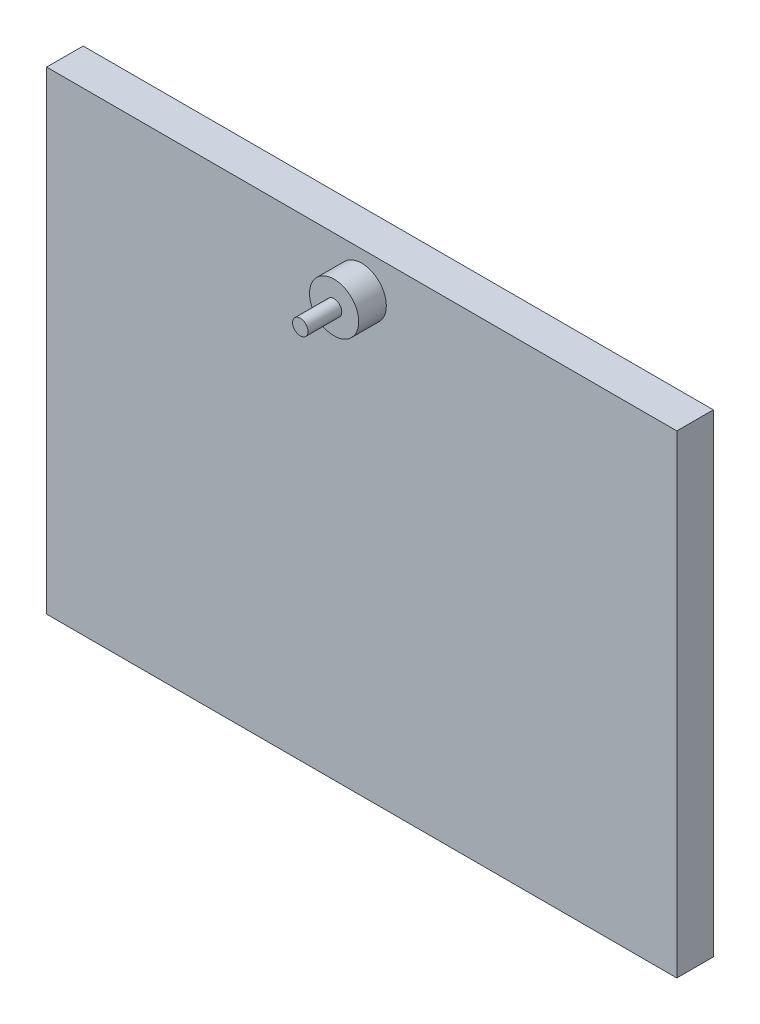
ISO-10303-21;
HEADER;
FILE_DESCRIPTION(('STEP AP214'),'2;1');
FILE_NAME('part.step','',(''),(''),'','','');
FILE_SCHEMA(('AUTOMOTIVE_DESIGN { 1 0 10303 214 1 1 1 1 }'));
ENDSEC;
DATA;
#1=APPLICATION_CONTEXT('core data for automotive mechanical design processes');
#2=APPLICATION_PROTOCOL_DEFINITION('international standard','automotive_design',2000,#1);
#3=PRODUCT_CONTEXT('',#1,'mechanical');
#4=PRODUCT('Part','Part','',(#3));
#5=PRODUCT_RELATED_PRODUCT_CATEGORY('part','',(#4));
#6=PRODUCT_DEFINITION_FORMATION('','',#4);
#7=PRODUCT_DEFINITION_CONTEXT('part definition',#1,'design');
#8=PRODUCT_DEFINITION('design','',#6,#7);
#9=PRODUCT_DEFINITION_SHAPE('','',#8);
#10=(LENGTH_UNIT() NAMED_UNIT(*) SI_UNIT(.MILLI.,.METRE.));
#11=(NAMED_UNIT(*) PLANE_ANGLE_UNIT() SI_UNIT($,.RADIAN.));
#12=(NAMED_UNIT(*) SI_UNIT($,.STERADIAN.) SOLID_ANGLE_UNIT());
#13=UNCERTAINTY_MEASURE_WITH_UNIT(LENGTH_MEASURE(1.E-05),#10,'distance_accuracy_value','');
#14=(GEOMETRIC_REPRESENTATION_CONTEXT(3) GLOBAL_UNCERTAINTY_ASSIGNED_CONTEXT((#13)) GLOBAL_UNIT_ASSIGNED_CONTEXT((#10,
#11,#12)) REPRESENTATION_CONTEXT('',''));
#15=CARTESIAN_POINT('',(0.,0.,0.));
#16=DIRECTION('',(0.,0.,1.));
#17=DIRECTION('',(1.,0.,0.));
#18=AXIS2_PLACEMENT_3D('',#15,#16,#17);
#19=CARTESIAN_POINT('',(-51.275,-38.55,5.94));
#20=DIRECTION('',(1.,0.,0.));
#21=DIRECTION('',(0.,0.,-1.));
#22=AXIS2_PLACEMENT_3D('',#19,#20,#21);
#23=PLANE('',#22);
#24=DIRECTION('',(0.,-1.,0.));
#25=VECTOR('',#24,1.);
#26=CARTESIAN_POINT('',(-51.275,-38.55,0.));
#27=LINE('',#26,#25);
#28=CARTESIAN_POINT('',(-51.275,38.55,0.));
#29=VERTEX_POINT('',#28);
#30=CARTESIAN_POINT('',(-51.275,-38.55,0.));
#31=VERTEX_POINT('',#30);
#32=EDGE_CURVE('E102',#29,#31,#27,.T.);
#33=ORIENTED_EDGE('',*,*,#32,.T.);
#34=DIRECTION('',(0.,0.,-1.));
#35=VECTOR('',#34,1.);
#36=CARTESIAN_POINT('',(-51.275,-38.55,5.94));
#37=LINE('',#36,#35);
#38=CARTESIAN_POINT('',(-51.275,-38.55,5.94));
#39=VERTEX_POINT('',#38);
#40=EDGE_CURVE('E93',#39,#31,#37,.T.);
#41=ORIENTED_EDGE('',*,*,#40,.F.);
#42=DIRECTION('',(0.,-1.,0.));
#43=VECTOR('',#42,1.);
#44=CARTESIAN_POINT('',(-51.275,-38.55,5.94));
#45=LINE('',#44,#43);
#46=CARTESIAN_POINT('',(-51.275,38.55,5.94));
#47=VERTEX_POINT('',#46);
#48=EDGE_CURVE('E87',#47,#39,#45,.T.);
#49=ORIENTED_EDGE('',*,*,#48,.F.);
#50=DIRECTION('',(0.,0.,-1.));
#51=VECTOR('',#50,1.);
#52=CARTESIAN_POINT('',(-51.275,38.55,5.94));
#53=LINE('',#52,#51);
#54=EDGE_CURVE('E98',#47,#29,#53,.T.);
#55=ORIENTED_EDGE('',*,*,#54,.T.);
#56=EDGE_LOOP('',(#33,#41,#49,#55));
#57=FACE_BOUND('',#56,.T.);
#58=ADVANCED_FACE('F33',(#57),#23,.F.);
#59=CARTESIAN_POINT('',(51.275,-38.55,5.94));
#60=DIRECTION('',(0.,1.,0.));
#61=DIRECTION('',(-1.,0.,0.));
#62=AXIS2_PLACEMENT_3D('',#59,#60,#61);
#63=PLANE('',#62);
#64=DIRECTION('',(1.,0.,0.));
#65=VECTOR('',#64,1.);
#66=CARTESIAN_POINT('',(51.275,-38.55,0.));
#67=LINE('',#66,#65);
#68=CARTESIAN_POINT('',(51.275,-38.55,0.));
#69=VERTEX_POINT('',#68);
#70=EDGE_CURVE('E92',#31,#69,#67,.T.);
#71=ORIENTED_EDGE('',*,*,#70,.T.);
#72=DIRECTION('',(0.,0.,-1.));
#73=VECTOR('',#72,1.);
#74=CARTESIAN_POINT('',(51.275,-38.55,5.94));
#75=LINE('',#74,#73);
#76=CARTESIAN_POINT('',(51.275,-38.55,5.94));
#77=VERTEX_POINT('',#76);
#78=EDGE_CURVE('E90',#77,#69,#75,.T.);
#79=ORIENTED_EDGE('',*,*,#78,.F.);
#80=DIRECTION('',(1.,0.,0.));
#81=VECTOR('',#80,1.);
#82=CARTESIAN_POINT('',(51.275,-38.55,5.94));
#83=LINE('',#82,#81);
#84=EDGE_CURVE('E82',#39,#77,#83,.T.);
#85=ORIENTED_EDGE('',*,*,#84,.F.);
#86=ORIENTED_EDGE('',*,*,#40,.T.);
#87=EDGE_LOOP('',(#71,#79,#85,#86));
#88=FACE_BOUND('',#87,.T.);
#89=ADVANCED_FACE('F91',(#88),#63,.F.);
#90=CARTESIAN_POINT('',(51.275,-38.55,5.94));
#91=DIRECTION('',(-1.,0.,0.));
#92=DIRECTION('',(0.,0.,1.));
#93=AXIS2_PLACEMENT_3D('',#90,#91,#92);
#94=PLANE('',#93);
#95=DIRECTION('',(0.,1.,0.));
#96=VECTOR('',#95,1.);
#97=CARTESIAN_POINT('',(51.275,-38.55,0.));
#98=LINE('',#97,#96);
#99=CARTESIAN_POINT('',(51.275,38.55,0.));
#100=VERTEX_POINT('',#99);
#101=EDGE_CURVE('E68',#69,#100,#98,.T.);
#102=ORIENTED_EDGE('',*,*,#101,.T.);
#103=DIRECTION('',(0.,0.,-1.));
#104=VECTOR('',#103,1.);
#105=CARTESIAN_POINT('',(51.275,38.55,5.94));
#106=LINE('',#105,#104);
#107=CARTESIAN_POINT('',(51.275,38.55,5.94));
#108=VERTEX_POINT('',#107);
#109=EDGE_CURVE('E94',#108,#100,#106,.T.);
#110=ORIENTED_EDGE('',*,*,#109,.F.);
#111=DIRECTION('',(0.,1.,0.));
#112=VECTOR('',#111,1.);
#113=CARTESIAN_POINT('',(51.275,-38.55,5.94));
#114=LINE('',#113,#112);
#115=EDGE_CURVE('E85',#77,#108,#114,.T.);
#116=ORIENTED_EDGE('',*,*,#115,.F.);
#117=ORIENTED_EDGE('',*,*,#78,.T.);
#118=EDGE_LOOP('',(#102,#110,#116,#117));
#119=FACE_BOUND('',#118,.T.);
#120=ADVANCED_FACE('F96',(#119),#94,.F.);
#121=CARTESIAN_POINT('',(51.275,38.55,5.94));
#122=DIRECTION('',(0.,-1.,0.));
#123=DIRECTION('',(1.,0.,0.));
#124=AXIS2_PLACEMENT_3D('',#121,#122,#123);
#125=PLANE('',#124);
#126=DIRECTION('',(-1.,0.,0.));
#127=VECTOR('',#126,1.);
#128=CARTESIAN_POINT('',(51.275,38.55,0.));
#129=LINE('',#128,#127);
#130=EDGE_CURVE('E74',#100,#29,#129,.T.);
#131=ORIENTED_EDGE('',*,*,#130,.T.);
#132=ORIENTED_EDGE('',*,*,#54,.F.);
#133=DIRECTION('',(-1.,0.,0.));
#134=VECTOR('',#133,1.);
#135=CARTESIAN_POINT('',(51.275,38.55,5.94));
#136=LINE('',#135,#134);
#137=EDGE_CURVE('E51',#108,#47,#136,.T.);
#138=ORIENTED_EDGE('',*,*,#137,.F.);
#139=ORIENTED_EDGE('',*,*,#109,.T.);
#140=EDGE_LOOP('',(#131,#132,#138,#139));
#141=FACE_BOUND('',#140,.T.);
#142=ADVANCED_FACE('F169',(#141),#125,.F.);
#143=CARTESIAN_POINT('',(0.,0.,5.94));
#144=DIRECTION('',(0.,0.,1.));
#145=DIRECTION('',(1.,0.,0.));
#146=AXIS2_PLACEMENT_3D('',#143,#144,#145);
#147=PLANE('',#146);
#148=CARTESIAN_POINT('',(0.,32.55,5.94));
#149=DIRECTION('',(0.,0.,1.));
#150=DIRECTION('',(1.,0.,0.));
#151=AXIS2_PLACEMENT_3D('',#148,#149,#150);
#152=CIRCLE('',#151,4.);
#153=CARTESIAN_POINT('',(4.,32.55,5.94));
#154=VERTEX_POINT('',#153);
#155=EDGE_CURVE('E447',#154,#154,#152,.T.);
#156=ORIENTED_EDGE('',*,*,#155,.F.);
#157=EDGE_LOOP('',(#156));
#158=FACE_BOUND('',#157,.T.);
#159=ORIENTED_EDGE('',*,*,#48,.T.);
#160=ORIENTED_EDGE('',*,*,#84,.T.);
#161=ORIENTED_EDGE('',*,*,#115,.T.);
#162=ORIENTED_EDGE('',*,*,#137,.T.);
#163=EDGE_LOOP('',(#159,#160,#161,#162));
#164=FACE_BOUND('',#163,.T.);
#165=ADVANCED_FACE('F83',(#158,#164),#147,.T.);
#166=CARTESIAN_POINT('',(0.,0.,0.));
#167=DIRECTION('',(0.,0.,1.));
#168=DIRECTION('',(1.,0.,0.));
#169=AXIS2_PLACEMENT_3D('',#166,#167,#168);
#170=PLANE('',#169);
#171=CARTESIAN_POINT('',(-30.,-32.55,0.));
#172=DIRECTION('',(0.,0.,1.));
#173=DIRECTION('',(1.,0.,0.));
#174=AXIS2_PLACEMENT_3D('',#171,#172,#173);
#175=CIRCLE('',#174,3.99999999999999);
#176=CARTESIAN_POINT('',(-26.,-32.55,0.));
#177=VERTEX_POINT('',#176);
#178=EDGE_CURVE('E36',#177,#177,#175,.F.);
#179=ORIENTED_EDGE('',*,*,#178,.F.);
#180=EDGE_LOOP('',(#179));
#181=FACE_BOUND('',#180,.T.);
#182=CARTESIAN_POINT('',(-15.,-32.55,0.));
#183=DIRECTION('',(0.,0.,1.));
#184=DIRECTION('',(1.,0.,0.));
#185=AXIS2_PLACEMENT_3D('',#182,#183,#184);
#186=CIRCLE('',#185,4.);
#187=CARTESIAN_POINT('',(-11.,-32.55,0.));
#188=VERTEX_POINT('',#187);
#189=EDGE_CURVE('E120',#188,#188,#186,.F.);
#190=ORIENTED_EDGE('',*,*,#189,.F.);
#191=EDGE_LOOP('',(#190));
#192=FACE_BOUND('',#191,.T.);
#193=CARTESIAN_POINT('',(0.,-32.55,0.));
#194=DIRECTION('',(0.,0.,1.));
#195=DIRECTION('',(1.,0.,0.));
#196=AXIS2_PLACEMENT_3D('',#193,#194,#195);
#197=CIRCLE('',#196,4.);
#198=CARTESIAN_POINT('',(4.,-32.55,0.));
#199=VERTEX_POINT('',#198);
#200=EDGE_CURVE('E118',#199,#199,#197,.F.);
#201=ORIENTED_EDGE('',*,*,#200,.F.);
#202=EDGE_LOOP('',(#201));
#203=FACE_BOUND('',#202,.T.);
#204=CARTESIAN_POINT('',(15.,-32.55,0.));
#205=DIRECTION('',(0.,0.,1.));
#206=DIRECTION('',(1.,0.,0.));
#207=AXIS2_PLACEMENT_3D('',#204,#205,#206);
#208=CIRCLE('',#207,4.);
#209=CARTESIAN_POINT('',(19.,-32.55,0.));
#210=VERTEX_POINT('',#209);
#211=EDGE_CURVE('E115',#210,#210,#208,.F.);
#212=ORIENTED_EDGE('',*,*,#211,.F.);
#213=EDGE_LOOP('',(#212));
#214=FACE_BOUND('',#213,.T.);
#215=CARTESIAN_POINT('',(30.,-32.55,0.));
#216=DIRECTION('',(0.,0.,1.));
#217=DIRECTION('',(1.,0.,0.));
#218=AXIS2_PLACEMENT_3D('',#215,#216,#217);
#219=CIRCLE('',#218,4.);
#220=CARTESIAN_POINT('',(34.,-32.55,0.));
#221=VERTEX_POINT('',#220);
#222=EDGE_CURVE('E112',#221,#221,#219,.F.);
#223=ORIENTED_EDGE('',*,*,#222,.F.);
#224=EDGE_LOOP('',(#223));
#225=FACE_BOUND('',#224,.T.);
#226=ORIENTED_EDGE('',*,*,#32,.F.);
#227=ORIENTED_EDGE('',*,*,#130,.F.);
#228=ORIENTED_EDGE('',*,*,#101,.F.);
#229=ORIENTED_EDGE('',*,*,#70,.F.);
#230=EDGE_LOOP('',(#226,#227,#228,#229));
#231=FACE_BOUND('',#230,.T.);
#232=ADVANCED_FACE('F159',(#181,#192,#203,#214,#225,#231),#170,.F.);
#233=CARTESIAN_POINT('',(30.,-32.55,-4.5));
#234=DIRECTION('',(0.,0.,1.));
#235=DIRECTION('',(1.,0.,0.));
#236=AXIS2_PLACEMENT_3D('',#233,#234,#235);
#237=CYLINDRICAL_SURFACE('',#236,4.);
#238=CARTESIAN_POINT('',(30.,-32.55,-4.5));
#239=DIRECTION('',(0.,0.,-1.));
#240=DIRECTION('',(-1.,0.,0.));
#241=AXIS2_PLACEMENT_3D('',#238,#239,#240);
#242=CIRCLE('',#241,4.);
#243=CARTESIAN_POINT('',(26.,-32.55,-4.5));
#244=VERTEX_POINT('',#243);
#245=EDGE_CURVE('E105',#244,#244,#242,.T.);
#246=ORIENTED_EDGE('',*,*,#245,.F.);
#247=EDGE_LOOP('',(#246));
#248=FACE_BOUND('',#247,.T.);
#249=ORIENTED_EDGE('',*,*,#222,.T.);
#250=EDGE_LOOP('',(#249));
#251=FACE_BOUND('',#250,.T.);
#252=ADVANCED_FACE('F156',(#248,#251),#237,.T.);
#253=CARTESIAN_POINT('',(30.,-32.55,-4.5));
#254=DIRECTION('',(0.,0.,-1.));
#255=DIRECTION('',(-1.,0.,0.));
#256=AXIS2_PLACEMENT_3D('',#253,#254,#255);
#257=PLANE('',#256);
#258=CARTESIAN_POINT('',(30.,-32.55,-4.5));
#259=DIRECTION('',(0.,0.,-1.));
#260=DIRECTION('',(-1.,0.,0.));
#261=AXIS2_PLACEMENT_3D('',#258,#259,#260);
#262=CIRCLE('',#261,1.25);
#263=CARTESIAN_POINT('',(28.75,-32.55,-4.5));
#264=VERTEX_POINT('',#263);
#265=EDGE_CURVE('E125',#264,#264,#262,.T.);
#266=ORIENTED_EDGE('',*,*,#265,.F.);
#267=EDGE_LOOP('',(#266));
#268=FACE_BOUND('',#267,.T.);
#269=ORIENTED_EDGE('',*,*,#245,.T.);
#270=EDGE_LOOP('',(#269));
#271=FACE_BOUND('',#270,.T.);
#272=ADVANCED_FACE('F154',(#268,#271),#257,.T.);
#273=CARTESIAN_POINT('',(15.,-32.55,-4.5));
#274=DIRECTION('',(0.,0.,1.));
#275=DIRECTION('',(1.,0.,0.));
#276=AXIS2_PLACEMENT_3D('',#273,#274,#275);
#277=CYLINDRICAL_SURFACE('',#276,4.);
#278=CARTESIAN_POINT('',(15.,-32.55,-4.5));
#279=DIRECTION('',(0.,0.,-1.));
#280=DIRECTION('',(-1.,0.,0.));
#281=AXIS2_PLACEMENT_3D('',#278,#279,#280);
#282=CIRCLE('',#281,4.);
#283=CARTESIAN_POINT('',(11.,-32.55,-4.5));
#284=VERTEX_POINT('',#283);
#285=EDGE_CURVE('E148',#284,#284,#282,.T.);
#286=ORIENTED_EDGE('',*,*,#285,.F.);
#287=EDGE_LOOP('',(#286));
#288=FACE_BOUND('',#287,.T.);
#289=ORIENTED_EDGE('',*,*,#211,.T.);
#290=EDGE_LOOP('',(#289));
#291=FACE_BOUND('',#290,.T.);
#292=ADVANCED_FACE('F213',(#288,#291),#277,.T.);
#293=CARTESIAN_POINT('',(15.,-32.55,-4.5));
#294=DIRECTION('',(0.,0.,-1.));
#295=DIRECTION('',(-1.,0.,0.));
#296=AXIS2_PLACEMENT_3D('',#293,#294,#295);
#297=PLANE('',#296);
#298=CARTESIAN_POINT('',(15.,-32.55,-4.5));
#299=DIRECTION('',(0.,0.,-1.));
#300=DIRECTION('',(-1.,0.,0.));
#301=AXIS2_PLACEMENT_3D('',#298,#299,#300);
#302=CIRCLE('',#301,1.25);
#303=CARTESIAN_POINT('',(13.75,-32.55,-4.5));
#304=VERTEX_POINT('',#303);
#305=EDGE_CURVE('E129',#304,#304,#302,.T.);
#306=ORIENTED_EDGE('',*,*,#305,.F.);
#307=EDGE_LOOP('',(#306));
#308=FACE_BOUND('',#307,.T.);
#309=ORIENTED_EDGE('',*,*,#285,.T.);
#310=EDGE_LOOP('',(#309));
#311=FACE_BOUND('',#310,.T.);
#312=ADVANCED_FACE('F218',(#308,#311),#297,.T.);
#313=CARTESIAN_POINT('',(0.,-32.55,-4.5));
#314=DIRECTION('',(0.,0.,1.));
#315=DIRECTION('',(1.,0.,0.));
#316=AXIS2_PLACEMENT_3D('',#313,#314,#315);
#317=CYLINDRICAL_SURFACE('',#316,4.);
#318=CARTESIAN_POINT('',(0.,-32.55,-4.5));
#319=DIRECTION('',(0.,0.,-1.));
#320=DIRECTION('',(-1.,0.,0.));
#321=AXIS2_PLACEMENT_3D('',#318,#319,#320);
#322=CIRCLE('',#321,4.);
#323=CARTESIAN_POINT('',(-4.,-32.55,-4.5));
#324=VERTEX_POINT('',#323);
#325=EDGE_CURVE('E145',#324,#324,#322,.T.);
#326=ORIENTED_EDGE('',*,*,#325,.F.);
#327=EDGE_LOOP('',(#326));
#328=FACE_BOUND('',#327,.T.);
#329=ORIENTED_EDGE('',*,*,#200,.T.);
#330=EDGE_LOOP('',(#329));
#331=FACE_BOUND('',#330,.T.);
#332=ADVANCED_FACE('F226',(#328,#331),#317,.T.);
#333=CARTESIAN_POINT('',(0.,-32.55,-4.5));
#334=DIRECTION('',(0.,0.,-1.));
#335=DIRECTION('',(-1.,0.,0.));
#336=AXIS2_PLACEMENT_3D('',#333,#334,#335);
#337=PLANE('',#336);
#338=CARTESIAN_POINT('',(0.,-32.55,-4.5));
#339=DIRECTION('',(0.,0.,-1.));
#340=DIRECTION('',(-1.,0.,0.));
#341=AXIS2_PLACEMENT_3D('',#338,#339,#340);
#342=CIRCLE('',#341,1.25);
#343=CARTESIAN_POINT('',(-1.25,-32.55,-4.5));
#344=VERTEX_POINT('',#343);
#345=EDGE_CURVE('E134',#344,#344,#342,.T.);
#346=ORIENTED_EDGE('',*,*,#345,.F.);
#347=EDGE_LOOP('',(#346));
#348=FACE_BOUND('',#347,.T.);
#349=ORIENTED_EDGE('',*,*,#325,.T.);
#350=EDGE_LOOP('',(#349));
#351=FACE_BOUND('',#350,.T.);
#352=ADVANCED_FACE('F231',(#348,#351),#337,.T.);
#353=CARTESIAN_POINT('',(-15.,-32.55,-4.5));
#354=DIRECTION('',(0.,0.,1.));
#355=DIRECTION('',(1.,0.,0.));
#356=AXIS2_PLACEMENT_3D('',#353,#354,#355);
#357=CYLINDRICAL_SURFACE('',#356,4.);
#358=CARTESIAN_POINT('',(-15.,-32.55,-4.5));
#359=DIRECTION('',(0.,0.,-1.));
#360=DIRECTION('',(-1.,0.,0.));
#361=AXIS2_PLACEMENT_3D('',#358,#359,#360);
#362=CIRCLE('',#361,4.);
#363=CARTESIAN_POINT('',(-19.,-32.55,-4.5));
#364=VERTEX_POINT('',#363);
#365=EDGE_CURVE('E142',#364,#364,#362,.T.);
#366=ORIENTED_EDGE('',*,*,#365,.F.);
#367=EDGE_LOOP('',(#366));
#368=FACE_BOUND('',#367,.T.);
#369=ORIENTED_EDGE('',*,*,#189,.T.);
#370=EDGE_LOOP('',(#369));
#371=FACE_BOUND('',#370,.T.);
#372=ADVANCED_FACE('F239',(#368,#371),#357,.T.);
#373=CARTESIAN_POINT('',(-15.,-32.55,-4.5));
#374=DIRECTION('',(0.,0.,-1.));
#375=DIRECTION('',(-1.,0.,0.));
#376=AXIS2_PLACEMENT_3D('',#373,#374,#375);
#377=PLANE('',#376);
#378=CARTESIAN_POINT('',(-15.,-32.55,-4.5));
#379=DIRECTION('',(0.,0.,-1.));
#380=DIRECTION('',(-1.,0.,0.));
#381=AXIS2_PLACEMENT_3D('',#378,#379,#380);
#382=CIRCLE('',#381,1.25);
#383=CARTESIAN_POINT('',(-16.25,-32.55,-4.5));
#384=VERTEX_POINT('',#383);
#385=EDGE_CURVE('E461',#384,#384,#382,.T.);
#386=ORIENTED_EDGE('',*,*,#385,.F.);
#387=EDGE_LOOP('',(#386));
#388=FACE_BOUND('',#387,.T.);
#389=ORIENTED_EDGE('',*,*,#365,.T.);
#390=EDGE_LOOP('',(#389));
#391=FACE_BOUND('',#390,.T.);
#392=ADVANCED_FACE('F244',(#388,#391),#377,.T.);
#393=CARTESIAN_POINT('',(-30.,-32.55,-4.5));
#394=DIRECTION('',(0.,0.,1.));
#395=DIRECTION('',(1.,0.,0.));
#396=AXIS2_PLACEMENT_3D('',#393,#394,#395);
#397=CYLINDRICAL_SURFACE('',#396,3.99999999999999);
#398=CARTESIAN_POINT('',(-30.,-32.55,-4.5));
#399=DIRECTION('',(0.,0.,-1.));
#400=DIRECTION('',(-1.,0.,0.));
#401=AXIS2_PLACEMENT_3D('',#398,#399,#400);
#402=CIRCLE('',#401,3.99999999999999);
#403=CARTESIAN_POINT('',(-34.,-32.55,-4.5));
#404=VERTEX_POINT('',#403);
#405=EDGE_CURVE('E139',#404,#404,#402,.T.);
#406=ORIENTED_EDGE('',*,*,#405,.F.);
#407=EDGE_LOOP('',(#406));
#408=FACE_BOUND('',#407,.T.);
#409=ORIENTED_EDGE('',*,*,#178,.T.);
#410=EDGE_LOOP('',(#409));
#411=FACE_BOUND('',#410,.T.);
#412=ADVANCED_FACE('F252',(#408,#411),#397,.T.);
#413=CARTESIAN_POINT('',(-30.,-32.55,-4.5));
#414=DIRECTION('',(0.,0.,-1.));
#415=DIRECTION('',(-1.,0.,0.));
#416=AXIS2_PLACEMENT_3D('',#413,#414,#415);
#417=PLANE('',#416);
#418=CARTESIAN_POINT('',(-30.,-32.55,-4.5));
#419=DIRECTION('',(0.,0.,-1.));
#420=DIRECTION('',(-1.,0.,0.));
#421=AXIS2_PLACEMENT_3D('',#418,#419,#420);
#422=CIRCLE('',#421,1.25);
#423=CARTESIAN_POINT('',(-31.25,-32.55,-4.5));
#424=VERTEX_POINT('',#423);
#425=EDGE_CURVE('E42',#424,#424,#422,.T.);
#426=ORIENTED_EDGE('',*,*,#425,.F.);
#427=EDGE_LOOP('',(#426));
#428=FACE_BOUND('',#427,.T.);
#429=ORIENTED_EDGE('',*,*,#405,.T.);
#430=EDGE_LOOP('',(#429));
#431=FACE_BOUND('',#430,.T.);
#432=ADVANCED_FACE('F257',(#428,#431),#417,.T.);
#433=CARTESIAN_POINT('',(30.,-32.55,-10.));
#434=DIRECTION('',(0.,0.,1.));
#435=DIRECTION('',(1.,0.,0.));
#436=AXIS2_PLACEMENT_3D('',#433,#434,#435);
#437=CYLINDRICAL_SURFACE('',#436,1.25);
#438=CARTESIAN_POINT('',(30.,-32.55,-10.));
#439=DIRECTION('',(0.,0.,-1.));
#440=DIRECTION('',(-1.,0.,0.));
#441=AXIS2_PLACEMENT_3D('',#438,#439,#440);
#442=CIRCLE('',#441,1.25);
#443=CARTESIAN_POINT('',(28.75,-32.55,-10.));
#444=VERTEX_POINT('',#443);
#445=EDGE_CURVE('E138',#444,#444,#442,.T.);
#446=ORIENTED_EDGE('',*,*,#445,.F.);
#447=EDGE_LOOP('',(#446));
#448=FACE_BOUND('',#447,.T.);
#449=ORIENTED_EDGE('',*,*,#265,.T.);
#450=EDGE_LOOP('',(#449));
#451=FACE_BOUND('',#450,.T.);
#452=ADVANCED_FACE('F295',(#448,#451),#437,.T.);
#453=CARTESIAN_POINT('',(30.,-32.55,-10.));
#454=DIRECTION('',(0.,0.,-1.));
#455=DIRECTION('',(-1.,0.,0.));
#456=AXIS2_PLACEMENT_3D('',#453,#454,#455);
#457=PLANE('',#456);
#458=ORIENTED_EDGE('',*,*,#445,.T.);
#459=EDGE_LOOP('',(#458));
#460=FACE_BOUND('',#459,.T.);
#461=ADVANCED_FACE('F305',(#460),#457,.T.);
#462=CARTESIAN_POINT('',(15.,-32.55,-10.));
#463=DIRECTION('',(0.,0.,1.));
#464=DIRECTION('',(1.,0.,0.));
#465=AXIS2_PLACEMENT_3D('',#462,#463,#464);
#466=CYLINDRICAL_SURFACE('',#465,1.25);
#467=CARTESIAN_POINT('',(15.,-32.55,-10.));
#468=DIRECTION('',(0.,0.,-1.));
#469=DIRECTION('',(-1.,0.,0.));
#470=AXIS2_PLACEMENT_3D('',#467,#468,#469);
#471=CIRCLE('',#470,1.25);
#472=CARTESIAN_POINT('',(13.75,-32.55,-10.));
#473=VERTEX_POINT('',#472);
#474=EDGE_CURVE('E469',#473,#473,#471,.T.);
#475=ORIENTED_EDGE('',*,*,#474,.F.);
#476=EDGE_LOOP('',(#475));
#477=FACE_BOUND('',#476,.T.);
#478=ORIENTED_EDGE('',*,*,#305,.T.);
#479=EDGE_LOOP('',(#478));
#480=FACE_BOUND('',#479,.T.);
#481=ADVANCED_FACE('F315',(#477,#480),#466,.T.);
#482=CARTESIAN_POINT('',(15.,-32.55,-10.));
#483=DIRECTION('',(0.,0.,-1.));
#484=DIRECTION('',(-1.,0.,0.));
#485=AXIS2_PLACEMENT_3D('',#482,#483,#484);
#486=PLANE('',#485);
#487=ORIENTED_EDGE('',*,*,#474,.T.);
#488=EDGE_LOOP('',(#487));
#489=FACE_BOUND('',#488,.T.);
#490=ADVANCED_FACE('F325',(#489),#486,.T.);
#491=CARTESIAN_POINT('',(0.,-32.55,-10.));
#492=DIRECTION('',(0.,0.,1.));
#493=DIRECTION('',(1.,0.,0.));
#494=AXIS2_PLACEMENT_3D('',#491,#492,#493);
#495=CYLINDRICAL_SURFACE('',#494,1.25);
#496=CARTESIAN_POINT('',(0.,-32.55,-10.));
#497=DIRECTION('',(0.,0.,-1.));
#498=DIRECTION('',(-1.,0.,0.));
#499=AXIS2_PLACEMENT_3D('',#496,#497,#498);
#500=CIRCLE('',#499,1.25);
#501=CARTESIAN_POINT('',(-1.25,-32.55,-10.));
#502=VERTEX_POINT('',#501);
#503=EDGE_CURVE('E464',#502,#502,#500,.T.);
#504=ORIENTED_EDGE('',*,*,#503,.F.);
#505=EDGE_LOOP('',(#504));
#506=FACE_BOUND('',#505,.T.);
#507=ORIENTED_EDGE('',*,*,#345,.T.);
#508=EDGE_LOOP('',(#507));
#509=FACE_BOUND('',#508,.T.);
#510=ADVANCED_FACE('F335',(#506,#509),#495,.T.);
#511=CARTESIAN_POINT('',(0.,-32.55,-10.));
#512=DIRECTION('',(0.,0.,-1.));
#513=DIRECTION('',(-1.,0.,0.));
#514=AXIS2_PLACEMENT_3D('',#511,#512,#513);
#515=PLANE('',#514);
#516=ORIENTED_EDGE('',*,*,#503,.T.);
#517=EDGE_LOOP('',(#516));
#518=FACE_BOUND('',#517,.T.);
#519=ADVANCED_FACE('F345',(#518),#515,.T.);
#520=CARTESIAN_POINT('',(-15.,-32.55,-10.));
#521=DIRECTION('',(0.,0.,1.));
#522=DIRECTION('',(1.,0.,0.));
#523=AXIS2_PLACEMENT_3D('',#520,#521,#522);
#524=CYLINDRICAL_SURFACE('',#523,1.25);
#525=CARTESIAN_POINT('',(-15.,-32.55,-10.));
#526=DIRECTION('',(0.,0.,-1.));
#527=DIRECTION('',(-1.,0.,0.));
#528=AXIS2_PLACEMENT_3D('',#525,#526,#527);
#529=CIRCLE('',#528,1.25);
#530=CARTESIAN_POINT('',(-16.25,-32.55,-10.));
#531=VERTEX_POINT('',#530);
#532=EDGE_CURVE('E458',#531,#531,#529,.T.);
#533=ORIENTED_EDGE('',*,*,#532,.F.);
#534=EDGE_LOOP('',(#533));
#535=FACE_BOUND('',#534,.T.);
#536=ORIENTED_EDGE('',*,*,#385,.T.);
#537=EDGE_LOOP('',(#536));
#538=FACE_BOUND('',#537,.T.);
#539=ADVANCED_FACE('F355',(#535,#538),#524,.T.);
#540=CARTESIAN_POINT('',(-15.,-32.55,-10.));
#541=DIRECTION('',(0.,0.,-1.));
#542=DIRECTION('',(-1.,0.,0.));
#543=AXIS2_PLACEMENT_3D('',#540,#541,#542);
#544=PLANE('',#543);
#545=ORIENTED_EDGE('',*,*,#532,.T.);
#546=EDGE_LOOP('',(#545));
#547=FACE_BOUND('',#546,.T.);
#548=ADVANCED_FACE('F365',(#547),#544,.T.);
#549=CARTESIAN_POINT('',(-30.,-32.55,-10.));
#550=DIRECTION('',(0.,0.,1.));
#551=DIRECTION('',(1.,0.,0.));
#552=AXIS2_PLACEMENT_3D('',#549,#550,#551);
#553=CYLINDRICAL_SURFACE('',#552,1.25);
#554=CARTESIAN_POINT('',(-30.,-32.55,-10.));
#555=DIRECTION('',(0.,0.,-1.));
#556=DIRECTION('',(-1.,0.,0.));
#557=AXIS2_PLACEMENT_3D('',#554,#555,#556);
#558=CIRCLE('',#557,1.25);
#559=CARTESIAN_POINT('',(-31.25,-32.55,-10.));
#560=VERTEX_POINT('',#559);
#561=EDGE_CURVE('E454',#560,#560,#558,.T.);
#562=ORIENTED_EDGE('',*,*,#561,.F.);
#563=EDGE_LOOP('',(#562));
#564=FACE_BOUND('',#563,.T.);
#565=ORIENTED_EDGE('',*,*,#425,.T.);
#566=EDGE_LOOP('',(#565));
#567=FACE_BOUND('',#566,.T.);
#568=ADVANCED_FACE('F375',(#564,#567),#553,.T.);
#569=CARTESIAN_POINT('',(-30.,-32.55,-10.));
#570=DIRECTION('',(0.,0.,-1.));
#571=DIRECTION('',(-1.,0.,0.));
#572=AXIS2_PLACEMENT_3D('',#569,#570,#571);
#573=PLANE('',#572);
#574=ORIENTED_EDGE('',*,*,#561,.T.);
#575=EDGE_LOOP('',(#574));
#576=FACE_BOUND('',#575,.T.);
#577=ADVANCED_FACE('F385',(#576),#573,.T.);
#578=CARTESIAN_POINT('',(0.,32.55,10.44));
#579=DIRECTION('',(0.,0.,-1.));
#580=DIRECTION('',(-1.,0.,0.));
#581=AXIS2_PLACEMENT_3D('',#578,#579,#580);
#582=CYLINDRICAL_SURFACE('',#581,4.);
#583=CARTESIAN_POINT('',(0.,32.55,10.44));
#584=DIRECTION('',(0.,0.,1.));
#585=DIRECTION('',(1.,0.,0.));
#586=AXIS2_PLACEMENT_3D('',#583,#584,#585);
#587=CIRCLE('',#586,4.);
#588=CARTESIAN_POINT('',(4.,32.55,10.44));
#589=VERTEX_POINT('',#588);
#590=EDGE_CURVE('E450',#589,#589,#587,.T.);
#591=ORIENTED_EDGE('',*,*,#590,.F.);
#592=EDGE_LOOP('',(#591));
#593=FACE_BOUND('',#592,.T.);
#594=ORIENTED_EDGE('',*,*,#155,.T.);
#595=EDGE_LOOP('',(#594));
#596=FACE_BOUND('',#595,.T.);
#597=ADVANCED_FACE('F395',(#593,#596),#582,.T.);
#598=CARTESIAN_POINT('',(0.,32.55,10.44));
#599=DIRECTION('',(0.,0.,1.));
#600=DIRECTION('',(1.,0.,0.));
#601=AXIS2_PLACEMENT_3D('',#598,#599,#600);
#602=PLANE('',#601);
#603=CARTESIAN_POINT('',(0.,32.55,10.44));
#604=DIRECTION('',(0.,0.,1.));
#605=DIRECTION('',(1.,0.,0.));
#606=AXIS2_PLACEMENT_3D('',#603,#604,#605);
#607=CIRCLE('',#606,1.25);
#608=CARTESIAN_POINT('',(1.25,32.55,10.44));
#609=VERTEX_POINT('',#608);
#610=EDGE_CURVE('E11',#609,#609,#607,.T.);
#611=ORIENTED_EDGE('',*,*,#610,.F.);
#612=EDGE_LOOP('',(#611));
#613=FACE_BOUND('',#612,.T.);
#614=ORIENTED_EDGE('',*,*,#590,.T.);
#615=EDGE_LOOP('',(#614));
#616=FACE_BOUND('',#615,.T.);
#617=ADVANCED_FACE('F410',(#613,#616),#602,.T.);
#618=CARTESIAN_POINT('',(0.,32.55,15.94));
#619=DIRECTION('',(0.,0.,-1.));
#620=DIRECTION('',(-1.,0.,0.));
#621=AXIS2_PLACEMENT_3D('',#618,#619,#620);
#622=CYLINDRICAL_SURFACE('',#621,1.25);
#623=CARTESIAN_POINT('',(0.,32.55,15.94));
#624=DIRECTION('',(0.,0.,1.));
#625=DIRECTION('',(1.,0.,0.));
#626=AXIS2_PLACEMENT_3D('',#623,#624,#625);
#627=CIRCLE('',#626,1.25);
#628=CARTESIAN_POINT('',(1.25,32.55,15.94));
#629=VERTEX_POINT('',#628);
#630=EDGE_CURVE('E446',#629,#629,#627,.T.);
#631=ORIENTED_EDGE('',*,*,#630,.F.);
#632=EDGE_LOOP('',(#631));
#633=FACE_BOUND('',#632,.T.);
#634=ORIENTED_EDGE('',*,*,#610,.T.);
#635=EDGE_LOOP('',(#634));
#636=FACE_BOUND('',#635,.T.);
#637=ADVANCED_FACE('F420',(#633,#636),#622,.T.);
#638=CARTESIAN_POINT('',(0.,32.55,15.94));
#639=DIRECTION('',(0.,0.,1.));
#640=DIRECTION('',(1.,0.,0.));
#641=AXIS2_PLACEMENT_3D('',#638,#639,#640);
#642=PLANE('',#641);
#643=ORIENTED_EDGE('',*,*,#630,.T.);
#644=EDGE_LOOP('',(#643));
#645=FACE_BOUND('',#644,.T.);
#646=ADVANCED_FACE('F430',(#645),#642,.T.);
#647=CLOSED_SHELL('',(#58,#89,#120,#142,#165,#232,#252,#272,#292,#312,#332,#352,#372,#392,#412,
#432,#452,#461,#481,#490,#510,#519,#539,#548,#568,#577,#597,#617,#637,#646));
#648=MANIFOLD_SOLID_BREP('B2',#647);
#649=ADVANCED_BREP_SHAPE_REPRESENTATION('',(#18,#648),#14);
#650=SHAPE_DEFINITION_REPRESENTATION(#9,#649);
ENDSEC;
END-ISO-10303-21;
